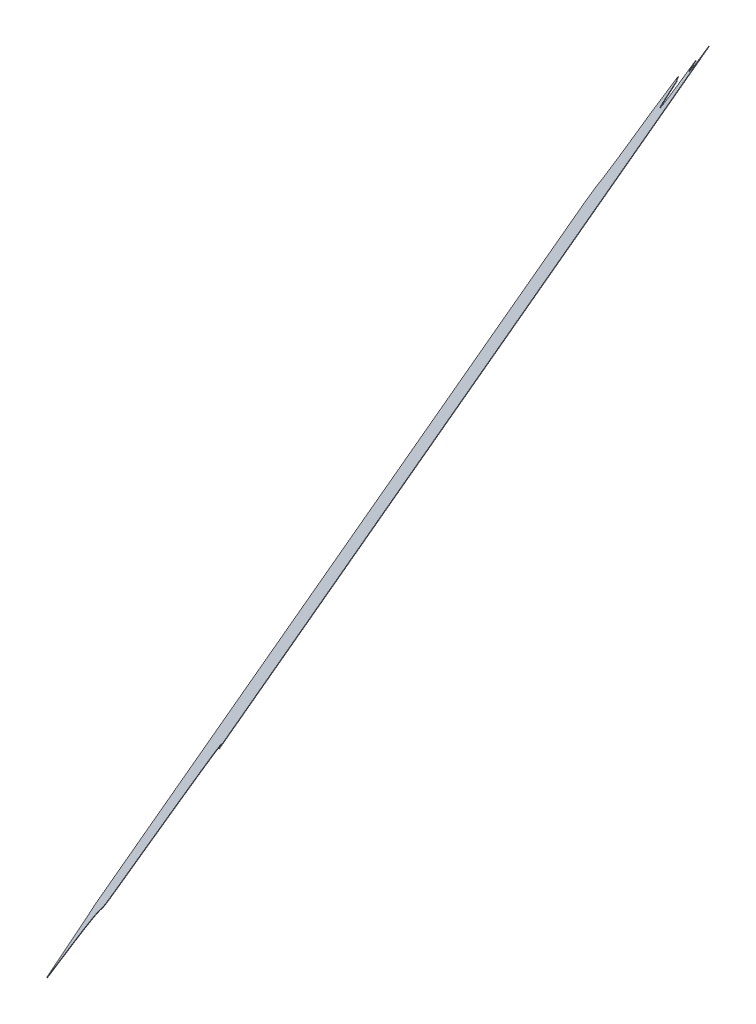
ISO-10303-21;
HEADER;
FILE_DESCRIPTION(('STEP AP214'),'2;1');
FILE_NAME('part.step','',(''),(''),'','','');
FILE_SCHEMA(('AUTOMOTIVE_DESIGN { 1 0 10303 214 1 1 1 1 }'));
ENDSEC;
DATA;
#1=APPLICATION_CONTEXT('core data for automotive mechanical design processes');
#2=APPLICATION_PROTOCOL_DEFINITION('international standard','automotive_design',2000,#1);
#3=PRODUCT_CONTEXT('',#1,'mechanical');
#4=PRODUCT('Part','Part','',(#3));
#5=PRODUCT_RELATED_PRODUCT_CATEGORY('part','',(#4));
#6=PRODUCT_DEFINITION_FORMATION('','',#4);
#7=PRODUCT_DEFINITION_CONTEXT('part definition',#1,'design');
#8=PRODUCT_DEFINITION('design','',#6,#7);
#9=PRODUCT_DEFINITION_SHAPE('','',#8);
#10=(LENGTH_UNIT() NAMED_UNIT(*) SI_UNIT(.MILLI.,.METRE.));
#11=(NAMED_UNIT(*) PLANE_ANGLE_UNIT() SI_UNIT($,.RADIAN.));
#12=(NAMED_UNIT(*) SI_UNIT($,.STERADIAN.) SOLID_ANGLE_UNIT());
#13=UNCERTAINTY_MEASURE_WITH_UNIT(LENGTH_MEASURE(1.E-05),#10,'distance_accuracy_value','');
#14=(GEOMETRIC_REPRESENTATION_CONTEXT(3) GLOBAL_UNCERTAINTY_ASSIGNED_CONTEXT((#13)) GLOBAL_UNIT_ASSIGNED_CONTEXT((#10,
#11,#12)) REPRESENTATION_CONTEXT('',''));
#15=CARTESIAN_POINT('',(0.,0.,0.));
#16=DIRECTION('',(0.,0.,1.));
#17=DIRECTION('',(1.,0.,0.));
#18=AXIS2_PLACEMENT_3D('',#15,#16,#17);
#19=CARTESIAN_POINT('',(2378.98586330096,525.802836481461,-13.0053149453881));
#20=CARTESIAN_POINT('',(2377.95048619296,525.234256569619,-14.5648775786979));
#21=CARTESIAN_POINT('',(2377.05251662314,524.480179693211,-15.5547361442591));
#22=CARTESIAN_POINT('',(2376.51053880873,524.025049640799,-16.152174409401));
#23=CARTESIAN_POINT('',(2375.47228998744,522.924832047889,-16.9792710675226));
#24=CARTESIAN_POINT('',(2374.4816957507,521.589286176894,-17.3711011531578));
#25=CARTESIAN_POINT('',(2373.61396610117,520.107998066241,-17.2814935268279));
#26=CARTESIAN_POINT('',(2373.23642727126,519.309794874412,-17.0288440016274));
#27=CARTESIAN_POINT('',(2372.61858630146,518.003538153108,-16.6153839405724));
#28=CARTESIAN_POINT('',(2372.08527277179,516.40840256996,-15.6085344689819));
#29=CARTESIAN_POINT('',(2371.661026262,515.128241786231,-14.7919652739403));
#30=CARTESIAN_POINT('',(2371.3044376191,513.709493935963,-13.6292015719265));
#31=CARTESIAN_POINT('',(2371.00750150893,512.528083713381,-12.6609527574912));
#32=CARTESIAN_POINT('',(2370.74303526046,511.201798996655,-11.4176326782293));
#33=CARTESIAN_POINT('',(2370.51752569134,510.070880035382,-10.3574574120617));
#34=CARTESIAN_POINT('',(2370.31041084756,508.808141508238,-9.07230240123195));
#35=CARTESIAN_POINT('',(2370.13244662952,507.723128621378,-7.96802806542277));
#36=CARTESIAN_POINT('',(2369.96126491284,506.498485847809,-6.65427268741517));
#37=CARTESIAN_POINT('',(2369.81716567713,505.467592531032,-5.54836517846949));
#38=CARTESIAN_POINT('',(2369.66409347263,504.23626044523,-4.18421013622098));
#39=CARTESIAN_POINT('',(2369.60083237433,503.727380205492,-3.6204373303769));
#40=CARTESIAN_POINT('',(2369.52728419044,503.114057526931,-2.93483572492473));
#41=CARTESIAN_POINT('',(2369.48391732098,502.752418623971,-2.5305783557931));
#42=CARTESIAN_POINT('',(2369.30517294324,501.242249762374,-0.837102069764316));
#43=CARTESIAN_POINT('',(2369.25999621537,500.868999121364,-0.420811889010696));
#44=CARTESIAN_POINT('',(2369.17968528452,500.205469294548,0.319229576941494));
#45=CARTESIAN_POINT('',(2369.11815396338,499.737635447647,0.829873246766278));
#46=CARTESIAN_POINT('',(2369.02996124873,499.067090167566,1.561777757037));
#47=CARTESIAN_POINT('',(2368.95241966779,498.584425716721,2.0566992121532));
#48=CARTESIAN_POINT('',(2368.90043391212,498.260835767778,2.38850655390385));
#49=CARTESIAN_POINT('',(2368.78329812853,497.651167907497,2.9701013029427));
#50=CARTESIAN_POINT('',(2368.71338142264,497.371508075547,3.20014901888518));
#51=CARTESIAN_POINT('',(2368.62103924177,497.002148586227,3.50398352485323));
#52=CARTESIAN_POINT('',(2368.4403612175,496.505163314007,3.78473218878658));
#53=CARTESIAN_POINT('',(2368.27210318452,496.134194848496,3.91850423969505));
#54=CARTESIAN_POINT('',(2368.06486322349,495.763891585507,3.9628780935986));
#55=CARTESIAN_POINT('',(2367.82826622419,495.406235693041,3.92304306599475));
#56=CARTESIAN_POINT('',(2367.47653222166,494.933689308545,3.78159193738589));
#57=CARTESIAN_POINT('',(2367.17782216072,494.581397741526,3.5933283446515));
#58=CARTESIAN_POINT('',(2366.95266722836,494.315855350052,3.45142325999345));
#59=CARTESIAN_POINT('',(2366.65698517721,493.987157878035,3.23723593780064));
#60=CARTESIAN_POINT('',(2366.43103591965,493.735979460286,3.07356192972205));
#61=CARTESIAN_POINT('',(2366.13842708481,493.419628304376,2.84918804507014));
#62=CARTESIAN_POINT('',(2365.91863901626,493.182006601746,2.68065347991716));
#63=CARTESIAN_POINT('',(2365.62021455958,492.863350642819,2.44628414182032));
#64=CARTESIAN_POINT('',(2365.44089594388,492.671875232015,2.30545525086442));
#65=CARTESIAN_POINT('',(2364.73623238226,491.922194165143,1.74821462176097));
#66=CARTESIAN_POINT('',(2364.57824600469,491.753788183044,1.62373465228368));
#67=CARTESIAN_POINT('',(2364.29361666252,491.450386809841,1.39947068490439));
#68=CARTESIAN_POINT('',(2363.49884187514,490.598243722331,0.780136825328038));
#69=CARTESIAN_POINT('',(2363.02307958304,490.077988249798,0.423506824970133));
#70=CARTESIAN_POINT('',(2362.47914520818,489.483185256952,0.0157752339520987));
#71=CARTESIAN_POINT('',(2361.44993518835,488.326183109015,-0.711875614328427));
#72=CARTESIAN_POINT('',(2359.87791061871,486.49948062064,-1.74060815894498));
#73=CARTESIAN_POINT('',(2357.85920881138,483.962327221928,-2.7955848828544));
#74=CARTESIAN_POINT('',(2355.89344980849,481.266584508941,-3.50996107345872));
#75=CARTESIAN_POINT('',(2354.00696709122,478.442349594944,-3.86580554331576));
#76=CARTESIAN_POINT('',(2353.07559507566,476.931591797833,-3.87967764642575));
#77=CARTESIAN_POINT('',(2352.21882138233,475.541838277286,-3.89243866223602));
#78=CARTESIAN_POINT('',(2351.30967701159,473.968106772552,-3.76832849173151));
#79=CARTESIAN_POINT('',(2350.89970110061,473.258437298644,-3.71236138479928));
#80=CARTESIAN_POINT('',(2350.45585450049,472.471351324407,-3.62565735238577));
#81=CARTESIAN_POINT('',(2350.07782001699,471.800971874255,-3.5518095092301));
#82=CARTESIAN_POINT('',(2349.4009610725,470.581329466304,-3.39269198174633));
#83=CARTESIAN_POINT('',(2348.99939992884,469.854466942097,-3.29372810723197));
#84=CARTESIAN_POINT('',(2348.54395941888,469.031235525686,-3.18309500624162));
#85=CARTESIAN_POINT('',(2348.3746889119,468.727411596368,-3.14495269199303));
#86=CARTESIAN_POINT('',(2348.13636975435,468.299652123265,-3.09125140426817));
#87=CARTESIAN_POINT('',(2347.9520060419,467.974611128578,-3.05787268566818));
#88=CARTESIAN_POINT('',(2347.71106140159,467.549815573576,-3.01425009182702));
#89=CARTESIAN_POINT('',(2347.51913558315,467.224293350162,-2.99736544794841));
#90=CARTESIAN_POINT('',(2347.26906299397,466.800149345422,-2.97536535100155));
#91=CARTESIAN_POINT('',(2346.94318604778,466.292012590469,-3.00866008972426));
#92=CARTESIAN_POINT('',(2346.69861049942,465.938931261904,-3.07296197380761));
#93=CARTESIAN_POINT('',(2346.44468266598,465.613922432459,-3.19751100219615));
#94=CARTESIAN_POINT('',(2346.18731122299,465.338061733721,-3.39819223411367));
#95=CARTESIAN_POINT('',(2345.93556789435,465.125120769091,-3.67355916146509));
#96=CARTESIAN_POINT('',(2345.69673124601,464.9704018501,-4.00056246771255));
#97=CARTESIAN_POINT('',(2345.38266277725,464.815111959173,-4.49751858771422));
#98=CARTESIAN_POINT('',(2345.1507798393,464.744816648923,-4.92608968978328));
#99=CARTESIAN_POINT('',(2344.97047867158,464.690158351786,-5.25932623939021));
#100=CARTESIAN_POINT('',(2344.57972573189,464.611684642948,-6.03710131488203));
#101=CARTESIAN_POINT('',(2344.37275105138,464.582031062254,-6.46563308410012));
#102=CARTESIAN_POINT('',(2344.06329743944,464.537695167498,-7.10634287277104));
#103=CARTESIAN_POINT('',(2343.63422519704,464.499504746074,-8.02708192625748));
#104=CARTESIAN_POINT('',(2343.34296271572,464.47358035431,-8.65209728468256));
#105=CARTESIAN_POINT('',(2342.9090759015,464.443031381775,-9.5943852298738));
#106=CARTESIAN_POINT('',(2342.84264443254,464.438354094856,-9.73865689319201));
#107=CARTESIAN_POINT('',(2342.18748677087,464.39378992435,-11.1636608166376));
#108=CARTESIAN_POINT('',(2341.76056044255,464.364750169797,-12.0922490458017));
#109=CARTESIAN_POINT('',(2341.46440303118,464.342510725014,-12.733496085689));
#110=CARTESIAN_POINT('',(2340.6523287176,464.281529364554,-14.4918186187658));
#111=CARTESIAN_POINT('',(2340.00372490056,464.211095600756,-15.8659888198961));
#112=CARTESIAN_POINT('',(2339.21161799369,464.125078421523,-17.54419310875));
#113=CARTESIAN_POINT('',(2338.51394927523,464.01038792688,-18.9682037677329));
#114=CARTESIAN_POINT('',(2337.70142221644,463.876815748828,-20.6266516267239));
#115=CARTESIAN_POINT('',(2336.97040492629,463.697109791135,-22.035977971112));
#116=CARTESIAN_POINT('',(2336.11160445534,463.485990898081,-23.691657179516));
#117=CARTESIAN_POINT('',(2335.33830230719,463.204726017414,-25.0557851365371));
#118=CARTESIAN_POINT('',(2334.411475482,462.867621255701,-26.690735183658));
#119=CARTESIAN_POINT('',(2333.58584523021,462.421932257931,-27.9450754707062));
#120=B_SPLINE_CURVE_WITH_KNOTS('',2,(#19,#20,#21,#22,#23,#24,#25,#26,#27,#28,#29,#30,#31,#32,
#33,#34,#35,#36,#37,#38,#39,#40,#41,#42,#43,#44,#45,#46,#47,#48,#49,#50,#51,#52,#53,#54,#55,#56,
#57,#58,#59,#60,#61,#62,#63,#64,#65,#66,#67,#68,#69,#70,#71,#72,#73,#74,#75,#76,#77,#78,#79,#80,
#81,#82,#83,#84,#85,#86,#87,#88,#89,#90,#91,#92,#93,#94,#95,#96,#97,#98,#99,#100,#101,#102,#103,
#104,#105,#106,#107,#108,#109,#110,#111,#112,#113,#114,#115,#116,#117,#118,#119),.UNSPECIFIED.,
.F.,.F.,(3,2,1,1,1,2,1,1,2,2,2,2,2,2,1,2,2,2,1,2,1,1,1,1,1,2,2,2,2,1,2,1,2,1,1,1,1,1,2,2,2,1,1,
1,2,2,2,1,1,1,1,1,1,1,2,1,2,2,2,2,2,2,2,2,2,3),(0.,0.03125,0.046875,0.0625,0.078125,0.09375,
0.124108791351318,0.125,0.15625,0.1875,0.21875,0.25,0.28125,0.296875,0.3125,0.328125,0.34375,
0.359375,0.3671875,0.375,0.3828125,0.38671875,0.390625,0.39453125,0.3984375,0.40625,0.4140625,
0.421875,0.4296875,0.4375,0.4453125,0.453125,0.46875,0.484375,0.5,0.53125,0.5625,0.59375,0.625,
0.65625,0.671875,0.6875,0.6953125,0.703125,0.7109375,0.71875,0.7265625,0.734375,0.73828125,
0.7421875,0.74609375,0.75,0.75390625,0.7578125,0.765625,0.7734375,0.78125,0.796875,0.8125,
0.828125,0.84375,0.875,0.90625,0.9375,0.96875,1.),.UNSPECIFIED.);
#121=DIRECTION('',(-0.798283907615501,0.488907013026806,0.35172821248136));
#122=VECTOR('',#121,1.);
#123=SURFACE_OF_LINEAR_EXTRUSION('',#120,#122);
#124=CARTESIAN_POINT('',(2378.9060349102,525.851727182764,-12.9701421241399));
#125=CARTESIAN_POINT('',(2377.8706578022,525.283147270922,-14.5297047574497));
#126=CARTESIAN_POINT('',(2376.97268823238,524.529070394514,-15.519563323011));
#127=CARTESIAN_POINT('',(2376.43071041797,524.073940342102,-16.1170015881529));
#128=CARTESIAN_POINT('',(2375.39246159668,522.973722749192,-16.9440982462745));
#129=CARTESIAN_POINT('',(2374.40186735994,521.638176878197,-17.3359283319097));
#130=CARTESIAN_POINT('',(2373.53413771041,520.156888767543,-17.2463207055797));
#131=CARTESIAN_POINT('',(2373.15659888049,519.358685575715,-16.9936711803793));
#132=CARTESIAN_POINT('',(2372.5387579107,518.052428854411,-16.5802111193243));
#133=CARTESIAN_POINT('',(2372.00544438103,516.457293271263,-15.5733616477338));
#134=CARTESIAN_POINT('',(2371.58119787124,515.177132487533,-14.7567924526921));
#135=CARTESIAN_POINT('',(2371.22460922834,513.758384637265,-13.5940287506784));
#136=CARTESIAN_POINT('',(2370.92767311816,512.576974414684,-12.625779936243));
#137=CARTESIAN_POINT('',(2370.6632068697,511.250689697958,-11.3824598569812));
#138=CARTESIAN_POINT('',(2370.43769730058,510.119770736685,-10.3222845908135));
#139=CARTESIAN_POINT('',(2370.23058245679,508.857032209541,-9.03712957998382));
#140=CARTESIAN_POINT('',(2370.05261823876,507.772019322681,-7.93285524417464));
#141=CARTESIAN_POINT('',(2369.88143652208,506.547376549112,-6.61909986616704));
#142=CARTESIAN_POINT('',(2369.73733728637,505.516483232335,-5.51319235722136));
#143=CARTESIAN_POINT('',(2369.58426508187,504.285151146533,-4.14903731497285));
#144=CARTESIAN_POINT('',(2369.52100398357,503.776270906795,-3.58526450912877));
#145=CARTESIAN_POINT('',(2369.44745579967,503.162948228234,-2.8996629036766));
#146=CARTESIAN_POINT('',(2369.40408893021,502.801309325273,-2.49540553454497));
#147=CARTESIAN_POINT('',(2369.22534455248,501.291140463677,-0.801929248516187));
#148=CARTESIAN_POINT('',(2369.18016782461,500.917889822666,-0.385639067762567));
#149=CARTESIAN_POINT('',(2369.09985689376,500.254359995851,0.354402398189624));
#150=CARTESIAN_POINT('',(2369.03832557262,499.786526148949,0.865046068014408));
#151=CARTESIAN_POINT('',(2368.95013285797,499.115980868869,1.59695057828513));
#152=CARTESIAN_POINT('',(2368.87259127703,498.633316418024,2.09187203340133));
#153=CARTESIAN_POINT('',(2368.82060552136,498.30972646908,2.42367937515198));
#154=CARTESIAN_POINT('',(2368.70346973777,497.700058608799,3.00527412419083));
#155=CARTESIAN_POINT('',(2368.63355303188,497.420398776849,3.23532184013331));
#156=CARTESIAN_POINT('',(2368.54121085101,497.05103928753,3.53915634610136));
#157=CARTESIAN_POINT('',(2368.36053282674,496.55405401531,3.81990501003471));
#158=CARTESIAN_POINT('',(2368.19227479376,496.183085549799,3.95367706094318));
#159=CARTESIAN_POINT('',(2367.98503483272,495.81278228681,3.99805091484673));
#160=CARTESIAN_POINT('',(2367.74843783343,495.455126394344,3.95821588724288));
#161=CARTESIAN_POINT('',(2367.3967038309,494.982580009848,3.81676475863402));
#162=CARTESIAN_POINT('',(2367.09799376995,494.630288442828,3.62850116589963));
#163=CARTESIAN_POINT('',(2366.8728388376,494.364746051354,3.48659608124158));
#164=CARTESIAN_POINT('',(2366.57715678645,494.036048579337,3.27240875904877));
#165=CARTESIAN_POINT('',(2366.35120752889,493.784870161589,3.10873475097018));
#166=CARTESIAN_POINT('',(2366.05859869405,493.468519005679,2.88436086631827));
#167=CARTESIAN_POINT('',(2365.8388106255,493.230897303049,2.71582630116529));
#168=CARTESIAN_POINT('',(2365.54038616882,492.912241344122,2.48145696306845));
#169=CARTESIAN_POINT('',(2365.36106755312,492.720765933317,2.34062807211255));
#170=CARTESIAN_POINT('',(2364.6564039915,491.971084866445,1.7833874430091));
#171=CARTESIAN_POINT('',(2364.49841761393,491.802678884347,1.65890747353181));
#172=CARTESIAN_POINT('',(2364.21378827176,491.499277511144,1.43464350615252));
#173=CARTESIAN_POINT('',(2363.41901348438,490.647134423633,0.815309646576168));
#174=CARTESIAN_POINT('',(2362.94325119228,490.126878951101,0.458679646218263));
#175=CARTESIAN_POINT('',(2362.39931681742,489.532075958255,0.0509480552002284));
#176=CARTESIAN_POINT('',(2361.37010679759,488.375073810318,-0.676702793080297));
#177=CARTESIAN_POINT('',(2359.79808222795,486.548371321942,-1.70543533769685));
#178=CARTESIAN_POINT('',(2357.77938042062,484.01121792323,-2.76041206160627));
#179=CARTESIAN_POINT('',(2355.81362141773,481.315475210243,-3.47478825221059));
#180=CARTESIAN_POINT('',(2353.92713870046,478.491240296247,-3.83063272206763));
#181=CARTESIAN_POINT('',(2352.9957666849,476.980482499135,-3.84450482517762));
#182=CARTESIAN_POINT('',(2352.13899299157,475.590728978589,-3.85726584098789));
#183=CARTESIAN_POINT('',(2351.22984862082,474.016997473854,-3.73315567048338));
#184=CARTESIAN_POINT('',(2350.81987270984,473.307327999947,-3.67718856355115));
#185=CARTESIAN_POINT('',(2350.37602610973,472.52024202571,-3.59048453113764));
#186=CARTESIAN_POINT('',(2349.99799162623,471.849862575558,-3.51663668798197));
#187=CARTESIAN_POINT('',(2349.32113268173,470.630220167607,-3.3575191604982));
#188=CARTESIAN_POINT('',(2348.91957153807,469.903357643399,-3.25855528598384));
#189=CARTESIAN_POINT('',(2348.46413102812,469.080126226988,-3.14792218499349));
#190=CARTESIAN_POINT('',(2348.29486052113,468.776302297671,-3.1097798707449));
#191=CARTESIAN_POINT('',(2348.05654136358,468.348542824568,-3.05607858302004));
#192=CARTESIAN_POINT('',(2347.87217765114,468.023501829881,-3.02269986442005));
#193=CARTESIAN_POINT('',(2347.63123301082,467.598706274879,-2.97907727057889));
#194=CARTESIAN_POINT('',(2347.43930719239,467.273184051464,-2.96219262670028));
#195=CARTESIAN_POINT('',(2347.18923460321,466.849040046725,-2.94019252975342));
#196=CARTESIAN_POINT('',(2346.86335765702,466.340903291771,-2.97348726847613));
#197=CARTESIAN_POINT('',(2346.61878210866,465.987821963206,-3.03778915255948));
#198=CARTESIAN_POINT('',(2346.36485427521,465.662813133762,-3.16233818094802));
#199=CARTESIAN_POINT('',(2346.10748283223,465.386952435023,-3.36301941286554));
#200=CARTESIAN_POINT('',(2345.85573950359,465.174011470394,-3.63838634021696));
#201=CARTESIAN_POINT('',(2345.61690285524,465.019292551403,-3.96538964646442));
#202=CARTESIAN_POINT('',(2345.30283438649,464.864002660475,-4.46234576646609));
#203=CARTESIAN_POINT('',(2345.07095144854,464.793707350226,-4.89091686853516));
#204=CARTESIAN_POINT('',(2344.89065028082,464.739049053089,-5.22415341814209));
#205=CARTESIAN_POINT('',(2344.49989734113,464.660575344251,-6.0019284936339));
#206=CARTESIAN_POINT('',(2344.29292266061,464.630921763557,-6.43046026285199));
#207=CARTESIAN_POINT('',(2343.98346904868,464.586585868801,-7.07117005152291));
#208=CARTESIAN_POINT('',(2343.55439680628,464.548395447376,-7.99190910500935));
#209=CARTESIAN_POINT('',(2343.26313432495,464.522471055612,-8.61692446343443));
#210=CARTESIAN_POINT('',(2342.82924751074,464.491922083078,-9.55921240862567));
#211=CARTESIAN_POINT('',(2342.76281604178,464.487244796159,-9.70348407194388));
#212=CARTESIAN_POINT('',(2342.10765838011,464.442680625652,-11.1284879953895));
#213=CARTESIAN_POINT('',(2341.68073205179,464.413640871099,-12.0570762245535));
#214=CARTESIAN_POINT('',(2341.38457464042,464.391401426317,-12.6983232644409));
#215=CARTESIAN_POINT('',(2340.57250032684,464.330420065857,-14.4566457975177));
#216=CARTESIAN_POINT('',(2339.9238965098,464.259986302058,-15.830815998648));
#217=CARTESIAN_POINT('',(2339.13178960293,464.173969122826,-17.5090202875019));
#218=CARTESIAN_POINT('',(2338.43412088446,464.059278628183,-18.9330309464848));
#219=CARTESIAN_POINT('',(2337.62159382568,463.925706450131,-20.5914788054757));
#220=CARTESIAN_POINT('',(2336.89057653553,463.746000492438,-22.0008051498639));
#221=CARTESIAN_POINT('',(2336.03177606458,463.534881599383,-23.6564843582678));
#222=CARTESIAN_POINT('',(2335.25847391643,463.253616718717,-25.020612315289));
#223=CARTESIAN_POINT('',(2334.33164709124,462.916511957004,-26.6555623624098));
#224=CARTESIAN_POINT('',(2333.50601683945,462.470822959233,-27.909902649458));
#225=B_SPLINE_CURVE_WITH_KNOTS('',2,(#124,#125,#126,#127,#128,#129,#130,#131,#132,#133,#134,
#135,#136,#137,#138,#139,#140,#141,#142,#143,#144,#145,#146,#147,#148,#149,#150,#151,#152,#153,
#154,#155,#156,#157,#158,#159,#160,#161,#162,#163,#164,#165,#166,#167,#168,#169,#170,#171,#172,
#173,#174,#175,#176,#177,#178,#179,#180,#181,#182,#183,#184,#185,#186,#187,#188,#189,#190,#191,
#192,#193,#194,#195,#196,#197,#198,#199,#200,#201,#202,#203,#204,#205,#206,#207,#208,#209,#210,
#211,#212,#213,#214,#215,#216,#217,#218,#219,#220,#221,#222,#223,#224),.UNSPECIFIED.,.F.,.F.,(3,
2,1,1,1,2,1,1,2,2,2,2,2,2,1,2,2,2,1,2,1,1,1,1,1,2,2,2,2,1,2,1,2,1,1,1,1,1,2,2,2,1,1,1,2,2,2,1,1,
1,1,1,1,1,2,1,2,2,2,2,2,2,2,2,2,3),(0.,0.03125,0.046875,0.0625,0.078125,0.09375,
0.124108791351318,0.125,0.15625,0.1875,0.21875,0.25,0.28125,0.296875,0.3125,0.328125,0.34375,
0.359375,0.3671875,0.375,0.3828125,0.38671875,0.390625,0.39453125,0.3984375,0.40625,0.4140625,
0.421875,0.4296875,0.4375,0.4453125,0.453125,0.46875,0.484375,0.5,0.53125,0.5625,0.59375,0.625,
0.65625,0.671875,0.6875,0.6953125,0.703125,0.7109375,0.71875,0.7265625,0.734375,0.73828125,
0.7421875,0.74609375,0.75,0.75390625,0.7578125,0.765625,0.7734375,0.78125,0.796875,0.8125,
0.828125,0.84375,0.875,0.90625,0.9375,0.96875,1.),.UNSPECIFIED.);
#226=CARTESIAN_POINT('',(2378.9060349102,525.851727182764,-12.9701421241396));
#227=VERTEX_POINT('',#226);
#228=CARTESIAN_POINT('',(2333.50601683945,462.470822959233,-27.909902649458));
#229=VERTEX_POINT('',#228);
#230=EDGE_CURVE('E226',#227,#229,#225,.T.);
#231=ORIENTED_EDGE('',*,*,#230,.T.);
#232=DIRECTION('',(-0.798283907615501,0.488907013026806,0.35172821248136));
#233=VECTOR('',#232,1.);
#234=CARTESIAN_POINT('',(2333.58584523021,462.421932257931,-27.9450754707062));
#235=LINE('',#234,#233);
#236=CARTESIAN_POINT('',(2333.58584523021,462.421932257931,-27.9450754707062));
#237=VERTEX_POINT('',#236);
#238=EDGE_CURVE('E13',#237,#229,#235,.T.);
#239=ORIENTED_EDGE('',*,*,#238,.F.);
#240=CARTESIAN_POINT('',(2378.98586330096,525.802836481461,-13.0053149453877));
#241=VERTEX_POINT('',#240);
#242=EDGE_CURVE('E278',#241,#237,#120,.T.);
#243=ORIENTED_EDGE('',*,*,#242,.F.);
#244=DIRECTION('',(-0.798283907615501,0.488907013026806,0.35172821248136));
#245=VECTOR('',#244,1.);
#246=CARTESIAN_POINT('',(2378.98586330096,525.802836481461,-13.0053149453877));
#247=LINE('',#246,#245);
#248=EDGE_CURVE('E68',#241,#227,#247,.T.);
#249=ORIENTED_EDGE('',*,*,#248,.T.);
#250=EDGE_LOOP('',(#231,#239,#243,#249));
#251=FACE_BOUND('',#250,.T.);
#252=ADVANCED_FACE('F51',(#251),#123,.F.);
#253=CARTESIAN_POINT('',(2333.58584523021,462.421932257931,-27.9450754707056));
#254=DIRECTION('',(0.572173363057329,0.797953482989953,0.18944097125983));
#255=DIRECTION('',(-0.812669206458009,0.58272528765698,0.));
#256=AXIS2_PLACEMENT_3D('',#253,#254,#255);
#257=PLANE('',#256);
#258=DIRECTION('',(-0.188043732811793,0.352477193017377,-0.916732994362479));
#259=VECTOR('',#258,1.);
#260=CARTESIAN_POINT('',(2333.50601683944,462.470822959233,-27.9099026494575));
#261=LINE('',#260,#259);
#262=CARTESIAN_POINT('',(2302.34431198831,520.881651607037,-179.826494446805));
#263=VERTEX_POINT('',#262);
#264=EDGE_CURVE('E220',#229,#263,#261,.T.);
#265=ORIENTED_EDGE('',*,*,#264,.T.);
#266=DIRECTION('',(-0.798283907615501,0.488907013026806,0.35172821248136));
#267=VECTOR('',#266,1.);
#268=CARTESIAN_POINT('',(2302.42414037908,520.832760905735,-179.861667268053));
#269=LINE('',#268,#267);
#270=CARTESIAN_POINT('',(2302.42414037908,520.832760905735,-179.861667268053));
#271=VERTEX_POINT('',#270);
#272=EDGE_CURVE('E60',#271,#263,#269,.T.);
#273=ORIENTED_EDGE('',*,*,#272,.F.);
#274=DIRECTION('',(-0.188043732811793,0.352477193017377,-0.916732994362479));
#275=VECTOR('',#274,1.);
#276=CARTESIAN_POINT('',(2333.58584523021,462.421932257931,-27.9450754707056));
#277=LINE('',#276,#275);
#278=EDGE_CURVE('E109',#237,#271,#277,.T.);
#279=ORIENTED_EDGE('',*,*,#278,.F.);
#280=ORIENTED_EDGE('',*,*,#238,.T.);
#281=EDGE_LOOP('',(#265,#273,#279,#280));
#282=FACE_BOUND('',#281,.T.);
#283=ADVANCED_FACE('F213',(#282),#257,.F.);
#284=CARTESIAN_POINT('',(2303.50879295341,523.948753446937,-181.731207120574));
#285=CARTESIAN_POINT('',(2302.99030970947,522.276751641642,-180.583853669601));
#286=CARTESIAN_POINT('',(2302.42414037908,520.832760905735,-179.861667268053));
#287=B_SPLINE_CURVE_WITH_KNOTS('',2,(#284,#285,#286),.UNSPECIFIED.,.F.,.F.,(3,3),(0.,1.),.UNSPECIFIED.);
#288=DIRECTION('',(-0.798283907615501,0.488907013026806,0.35172821248136));
#289=VECTOR('',#288,1.);
#290=SURFACE_OF_LINEAR_EXTRUSION('',#287,#289);
#291=CARTESIAN_POINT('',(2303.42896456265,523.99764414824,-181.696034299325));
#292=CARTESIAN_POINT('',(2302.9104813187,522.325642342945,-180.548680848353));
#293=CARTESIAN_POINT('',(2302.34431198831,520.881651607037,-179.826494446805));
#294=B_SPLINE_CURVE_WITH_KNOTS('',2,(#291,#292,#293),.UNSPECIFIED.,.F.,.F.,(3,3),(0.,1.),.UNSPECIFIED.);
#295=CARTESIAN_POINT('',(2303.42896442417,523.997643701694,-181.696033992899));
#296=VERTEX_POINT('',#295);
#297=EDGE_CURVE('E225',#296,#263,#294,.T.);
#298=ORIENTED_EDGE('',*,*,#297,.F.);
#299=DIRECTION('',(-0.798283907615501,0.488907013026806,0.35172821248136));
#300=VECTOR('',#299,1.);
#301=CARTESIAN_POINT('',(2303.50879281494,523.948753000392,-181.731206814147));
#302=LINE('',#301,#300);
#303=CARTESIAN_POINT('',(2303.50879281494,523.948753000392,-181.731206814147));
#304=VERTEX_POINT('',#303);
#305=EDGE_CURVE('E286',#304,#296,#302,.T.);
#306=ORIENTED_EDGE('',*,*,#305,.F.);
#307=EDGE_CURVE('E199',#304,#271,#287,.T.);
#308=ORIENTED_EDGE('',*,*,#307,.T.);
#309=ORIENTED_EDGE('',*,*,#272,.T.);
#310=EDGE_LOOP('',(#298,#306,#308,#309));
#311=FACE_BOUND('',#310,.T.);
#312=ADVANCED_FACE('F210',(#311),#290,.T.);
#313=CARTESIAN_POINT('',(2303.50879295341,523.948753446937,-181.731207120574));
#314=CARTESIAN_POINT('',(2304.33330332581,524.867557181696,-181.137044454584));
#315=CARTESIAN_POINT('',(2305.84256699189,526.946062117429,-180.600763170926));
#316=CARTESIAN_POINT('',(2307.15133478719,529.16274548303,-180.711598105177));
#317=CARTESIAN_POINT('',(2307.75764387258,530.386973051902,-181.037209341328));
#318=CARTESIAN_POINT('',(2307.81450617571,530.50287064941,-181.069253647915));
#319=CARTESIAN_POINT('',(2308.32222922314,531.546059927007,-181.366970497817));
#320=CARTESIAN_POINT('',(2308.80619467513,532.69095622215,-181.859981833182));
#321=CARTESIAN_POINT('',(2308.85269137228,532.80174979005,-181.908457294187));
#322=CARTESIAN_POINT('',(2309.27804256405,533.822082583935,-182.361354848107));
#323=CARTESIAN_POINT('',(2309.69223195347,534.938122432219,-182.972619389129));
#324=CARTESIAN_POINT('',(2309.73191028898,535.045669671053,-183.032057392216));
#325=CARTESIAN_POINT('',(2310.09383430695,536.031979447142,-183.581617081662));
#326=CARTESIAN_POINT('',(2310.45595207155,537.114625480042,-184.264645753922));
#327=CARTESIAN_POINT('',(2310.4906077976,537.218718844187,-184.330682160744));
#328=CARTESIAN_POINT('',(2310.80667029022,538.172084828542,-184.938537051219));
#329=CARTESIAN_POINT('',(2311.13712294057,539.241171956086,-185.674585943513));
#330=CARTESIAN_POINT('',(2311.16795544306,539.341259838337,-185.743731880985));
#331=CARTESIAN_POINT('',(2311.4563482005,540.280257465007,-186.394413911686));
#332=CARTESIAN_POINT('',(2311.78440626646,541.39882177648,-187.204671523865));
#333=B_SPLINE_CURVE_WITH_KNOTS('',2,(#313,#314,#315,#316,#317,#318,#319,#320,#321,#322,#323,
#324,#325,#326,#327,#328,#329,#330,#331,#332),.UNSPECIFIED.,.F.,.F.,(3,1,1,1,1,1,1,1,1,1,1,1,1,
1,1,1,1,1,3),(0.,0.125,0.25,0.36875,0.375,0.38125,0.4940625,0.5,0.50625,0.6190625,0.625,0.63125,
0.7440625,0.75,0.75625,0.8690625,0.875,0.88125,1.),.UNSPECIFIED.);
#334=DIRECTION('',(-0.798283907615501,0.488907013026806,0.35172821248136));
#335=VECTOR('',#334,1.);
#336=SURFACE_OF_LINEAR_EXTRUSION('',#333,#335);
#337=CARTESIAN_POINT('',(2303.42896456265,523.99764414824,-181.696034299326));
#338=CARTESIAN_POINT('',(2304.25347493505,524.916447882999,-181.101871633336));
#339=CARTESIAN_POINT('',(2305.76273860113,526.994952818731,-180.565590349678));
#340=CARTESIAN_POINT('',(2307.07150639643,529.211636184332,-180.676425283929));
#341=CARTESIAN_POINT('',(2307.67781548182,530.435863753204,-181.00203652008));
#342=CARTESIAN_POINT('',(2307.73467778495,530.551761350712,-181.034080826667));
#343=CARTESIAN_POINT('',(2308.24240083238,531.594950628309,-181.331797676568));
#344=CARTESIAN_POINT('',(2308.72636628437,532.739846923452,-181.824809011934));
#345=CARTESIAN_POINT('',(2308.77286298152,532.850640491353,-181.873284472939));
#346=CARTESIAN_POINT('',(2309.19821417329,533.870973285237,-182.326182026858));
#347=CARTESIAN_POINT('',(2309.61240356271,534.987013133522,-182.937446567881));
#348=CARTESIAN_POINT('',(2309.65208189822,535.094560372355,-182.996884570968));
#349=CARTESIAN_POINT('',(2310.01400591619,536.080870148444,-183.546444260413));
#350=CARTESIAN_POINT('',(2310.37612368079,537.163516181345,-184.229472932674));
#351=CARTESIAN_POINT('',(2310.41077940684,537.26760954549,-184.295509339496));
#352=CARTESIAN_POINT('',(2310.72684189946,538.220975529845,-184.903364229971));
#353=CARTESIAN_POINT('',(2311.05729454981,539.290062657389,-185.639413122265));
#354=CARTESIAN_POINT('',(2311.08812705229,539.39015053964,-185.708559059737));
#355=CARTESIAN_POINT('',(2311.37651980974,540.329148166309,-186.359241090438));
#356=CARTESIAN_POINT('',(2311.7045778757,541.447712477782,-187.169498702617));
#357=B_SPLINE_CURVE_WITH_KNOTS('',2,(#337,#338,#339,#340,#341,#342,#343,#344,#345,#346,#347,
#348,#349,#350,#351,#352,#353,#354,#355,#356),.UNSPECIFIED.,.F.,.F.,(3,1,1,1,1,1,1,1,1,1,1,1,1,
1,1,1,1,1,3),(0.,0.125,0.25,0.36875,0.375,0.38125,0.4940625,0.5,0.50625,0.6190625,0.625,0.63125,
0.7440625,0.75,0.75625,0.8690625,0.875,0.88125,1.),.UNSPECIFIED.);
#358=CARTESIAN_POINT('',(2311.704577657,541.447711732072,-187.169498162445));
#359=VERTEX_POINT('',#358);
#360=EDGE_CURVE('E233',#296,#359,#357,.T.);
#361=ORIENTED_EDGE('',*,*,#360,.T.);
#362=DIRECTION('',(-0.798283907615501,0.488907013026806,0.35172821248136));
#363=VECTOR('',#362,1.);
#364=CARTESIAN_POINT('',(2311.78440604776,541.39882103077,-187.204670983693));
#365=LINE('',#364,#363);
#366=CARTESIAN_POINT('',(2311.78440604776,541.39882103077,-187.204670983693));
#367=VERTEX_POINT('',#366);
#368=EDGE_CURVE('E284',#367,#359,#365,.T.);
#369=ORIENTED_EDGE('',*,*,#368,.F.);
#370=EDGE_CURVE('E191',#304,#367,#333,.T.);
#371=ORIENTED_EDGE('',*,*,#370,.F.);
#372=ORIENTED_EDGE('',*,*,#305,.T.);
#373=EDGE_LOOP('',(#361,#369,#371,#372));
#374=FACE_BOUND('',#373,.T.);
#375=ADVANCED_FACE('F207',(#374),#336,.F.);
#376=CARTESIAN_POINT('',(2315.96859575956,549.557319390791,-189.04863950149));
#377=CARTESIAN_POINT('',(2315.87009412015,549.355544125355,-188.99172888699));
#378=CARTESIAN_POINT('',(2315.59474823759,548.789862497148,-188.830349941325));
#379=CARTESIAN_POINT('',(2315.20754588214,547.994222229829,-188.603195296459));
#380=CARTESIAN_POINT('',(2314.98164089777,547.533396718973,-188.475356502831));
#381=CARTESIAN_POINT('',(2314.94292886584,547.454464031886,-188.453499990118));
#382=CARTESIAN_POINT('',(2314.42287250527,546.395498309856,-188.161845409321));
#383=CARTESIAN_POINT('',(2313.98150812613,545.522431633536,-187.949993368506));
#384=CARTESIAN_POINT('',(2313.93225627187,545.42518489033,-187.926601295361));
#385=CARTESIAN_POINT('',(2313.41214923084,544.400545492332,-187.682775797811));
#386=CARTESIAN_POINT('',(2312.92253079853,543.47752212692,-187.511000890336));
#387=CARTESIAN_POINT('',(2312.86996130541,543.378668243655,-187.492904598437));
#388=CARTESIAN_POINT('',(2312.30730147158,542.323692896848,-187.303489725097));
#389=CARTESIAN_POINT('',(2311.78440626646,541.39882177648,-187.204671523865));
#390=B_SPLINE_CURVE_WITH_KNOTS('',2,(#376,#377,#378,#379,#380,#381,#382,#383,#384,#385,#386,
#387,#388,#389),.UNSPECIFIED.,.F.,.F.,(3,1,1,1,1,1,1,1,1,1,1,1,3),(0.,0.0625,0.125,0.24375,0.25,
0.2625,0.488125,0.5,0.5125,0.738125,0.75,0.7625,1.),.UNSPECIFIED.);
#391=DIRECTION('',(-0.798283907615501,0.488907013026806,0.35172821248136));
#392=VECTOR('',#391,1.);
#393=SURFACE_OF_LINEAR_EXTRUSION('',#390,#392);
#394=CARTESIAN_POINT('',(2315.8887673688,549.606210092094,-189.013466680241));
#395=CARTESIAN_POINT('',(2315.79026572939,549.404434826658,-188.956556065742));
#396=CARTESIAN_POINT('',(2315.51491984682,548.838753198451,-188.795177120077));
#397=CARTESIAN_POINT('',(2315.12771749138,548.043112931132,-188.568022475211));
#398=CARTESIAN_POINT('',(2314.90181250701,547.582287420276,-188.440183681583));
#399=CARTESIAN_POINT('',(2314.86310047507,547.503354733189,-188.418327168869));
#400=CARTESIAN_POINT('',(2314.34304411451,546.444389011159,-188.126672588073));
#401=CARTESIAN_POINT('',(2313.90167973537,545.571322334839,-187.914820547258));
#402=CARTESIAN_POINT('',(2313.85242788111,545.474075591633,-187.891428474113));
#403=CARTESIAN_POINT('',(2313.33232084008,544.449436193635,-187.647602976563));
#404=CARTESIAN_POINT('',(2312.84270240777,543.526412828223,-187.475828069088));
#405=CARTESIAN_POINT('',(2312.79013291465,543.427558944958,-187.457731777189));
#406=CARTESIAN_POINT('',(2312.22747308082,542.372583598151,-187.268316903849));
#407=CARTESIAN_POINT('',(2311.7045778757,541.447712477782,-187.169498702617));
#408=B_SPLINE_CURVE_WITH_KNOTS('',2,(#394,#395,#396,#397,#398,#399,#400,#401,#402,#403,#404,
#405,#406,#407),.UNSPECIFIED.,.F.,.F.,(3,1,1,1,1,1,1,1,1,1,1,1,3),(0.,0.0625,0.125,0.24375,0.25,
0.2625,0.488125,0.5,0.5125,0.738125,0.75,0.7625,1.),.UNSPECIFIED.);
#409=CARTESIAN_POINT('',(2315.8887671216,549.606209585718,-189.013466537419));
#410=VERTEX_POINT('',#409);
#411=EDGE_CURVE('E235',#410,#359,#408,.T.);
#412=ORIENTED_EDGE('',*,*,#411,.F.);
#413=DIRECTION('',(-0.798283907615501,0.488907013026806,0.35172821248136));
#414=VECTOR('',#413,1.);
#415=CARTESIAN_POINT('',(2315.96859551236,549.557318884416,-189.048639358667));
#416=LINE('',#415,#414);
#417=CARTESIAN_POINT('',(2315.96859551236,549.557318884416,-189.048639358667));
#418=VERTEX_POINT('',#417);
#419=EDGE_CURVE('E282',#418,#410,#416,.T.);
#420=ORIENTED_EDGE('',*,*,#419,.F.);
#421=EDGE_CURVE('E182',#418,#367,#390,.T.);
#422=ORIENTED_EDGE('',*,*,#421,.T.);
#423=ORIENTED_EDGE('',*,*,#368,.T.);
#424=EDGE_LOOP('',(#412,#420,#422,#423));
#425=FACE_BOUND('',#424,.T.);
#426=ADVANCED_FACE('F175',(#425),#393,.T.);
#427=CARTESIAN_POINT('',(2315.96859575956,549.557319390791,-189.04863950149));
#428=CARTESIAN_POINT('',(2316.08893578526,549.657485233838,-188.914747134742));
#429=CARTESIAN_POINT('',(2316.23126366496,549.774932468335,-188.754972407065));
#430=CARTESIAN_POINT('',(2316.42096935992,549.931475299497,-188.54201219284));
#431=CARTESIAN_POINT('',(2317.29028530249,550.64385629754,-187.559228186811));
#432=CARTESIAN_POINT('',(2317.53200186406,550.843002211847,-187.287442746256));
#433=CARTESIAN_POINT('',(2317.564671911,550.869936500601,-187.250733691906));
#434=CARTESIAN_POINT('',(2317.98975296446,551.220677983693,-186.773503297495));
#435=CARTESIAN_POINT('',(2318.71861816428,551.832611328902,-185.96986331119));
#436=CARTESIAN_POINT('',(2319.09217116342,552.154255454117,-185.569135492563));
#437=CARTESIAN_POINT('',(2319.15326836335,552.206933595759,-185.503692352655));
#438=CARTESIAN_POINT('',(2319.95709946265,552.902324192094,-184.645916146584));
#439=CARTESIAN_POINT('',(2320.67302629939,553.563784967468,-183.940484929877));
#440=CARTESIAN_POINT('',(2320.75072168675,553.635840563268,-183.86430539591));
#441=CARTESIAN_POINT('',(2321.58952304019,554.417226044883,-183.04669460981));
#442=CARTESIAN_POINT('',(2322.31968857643,555.160347691206,-182.422456902229));
#443=B_SPLINE_CURVE_WITH_KNOTS('',2,(#427,#428,#429,#430,#431,#432,#433,#434,#435,#436,#437,
#438,#439,#440,#441,#442),.UNSPECIFIED.,.F.,.F.,(3,2,1,1,1,1,1,1,1,1,1,1,1,3),(0.,
0.0416666666666667,0.125,0.24375,0.25,0.25625,0.375,0.49375,0.5,0.5125,0.738125,0.75,0.7625,1.),.UNSPECIFIED.);
#444=DIRECTION('',(-0.798283907615501,0.488907013026806,0.35172821248136));
#445=VECTOR('',#444,1.);
#446=SURFACE_OF_LINEAR_EXTRUSION('',#443,#445);
#447=CARTESIAN_POINT('',(2315.8887673688,549.606210092093,-189.013466680241));
#448=CARTESIAN_POINT('',(2316.0091073945,549.70637593514,-188.879574313494));
#449=CARTESIAN_POINT('',(2316.1514352742,549.823823169638,-188.719799585817));
#450=CARTESIAN_POINT('',(2316.34114096916,549.9803660008,-188.506839371591));
#451=CARTESIAN_POINT('',(2317.21045691173,550.692746998842,-187.524055365563));
#452=CARTESIAN_POINT('',(2317.4521734733,550.89189291315,-187.252269925008));
#453=CARTESIAN_POINT('',(2317.48484352024,550.918827201903,-187.215560870658));
#454=CARTESIAN_POINT('',(2317.9099245737,551.269568684996,-186.738330476247));
#455=CARTESIAN_POINT('',(2318.63878977352,551.881502030205,-185.934690489942));
#456=CARTESIAN_POINT('',(2319.01234277266,552.203146155419,-185.533962671314));
#457=CARTESIAN_POINT('',(2319.07343997259,552.255824297061,-185.468519531407));
#458=CARTESIAN_POINT('',(2319.87727107189,552.951214893397,-184.610743325335));
#459=CARTESIAN_POINT('',(2320.59319790863,553.612675668771,-183.905312108629));
#460=CARTESIAN_POINT('',(2320.67089329599,553.68473126457,-183.829132574662));
#461=CARTESIAN_POINT('',(2321.50969464943,554.466116746186,-183.011521788562));
#462=CARTESIAN_POINT('',(2322.23986018567,555.209238392509,-182.387284080981));
#463=B_SPLINE_CURVE_WITH_KNOTS('',2,(#447,#448,#449,#450,#451,#452,#453,#454,#455,#456,#457,
#458,#459,#460,#461,#462),.UNSPECIFIED.,.F.,.F.,(3,2,1,1,1,1,1,1,1,1,1,1,1,3),(0.,
0.0416666666666667,0.125,0.24375,0.25,0.25625,0.375,0.49375,0.5,0.5125,0.738125,0.75,0.7625,1.),.UNSPECIFIED.);
#464=CARTESIAN_POINT('',(2322.23985964512,555.209237842369,-182.38728454311));
#465=VERTEX_POINT('',#464);
#466=EDGE_CURVE('E251',#410,#465,#463,.T.);
#467=ORIENTED_EDGE('',*,*,#466,.T.);
#468=DIRECTION('',(-0.798283907615501,0.488907013026806,0.35172821248136));
#469=VECTOR('',#468,1.);
#470=CARTESIAN_POINT('',(2322.31968803588,555.160347141066,-182.422457364358));
#471=LINE('',#470,#469);
#472=CARTESIAN_POINT('',(2322.31968803588,555.160347141066,-182.422457364358));
#473=VERTEX_POINT('',#472);
#474=EDGE_CURVE('E137',#473,#465,#471,.T.);
#475=ORIENTED_EDGE('',*,*,#474,.F.);
#476=EDGE_CURVE('E146',#418,#473,#443,.T.);
#477=ORIENTED_EDGE('',*,*,#476,.F.);
#478=ORIENTED_EDGE('',*,*,#419,.T.);
#479=EDGE_LOOP('',(#467,#475,#477,#478));
#480=FACE_BOUND('',#479,.T.);
#481=ADVANCED_FACE('F172',(#480),#446,.F.);
#482=CARTESIAN_POINT('',(2337.68563346918,572.508747436112,-171.662352654641));
#483=CARTESIAN_POINT('',(2337.1861205411,570.851299978598,-170.492174832778));
#484=CARTESIAN_POINT('',(2336.62266730981,569.337936334259,-169.667394671714));
#485=CARTESIAN_POINT('',(2336.26202332924,568.38045234864,-169.154998045651));
#486=CARTESIAN_POINT('',(2335.52304841384,566.670278733105,-168.455014131101));
#487=CARTESIAN_POINT('',(2335.10890070634,565.850135245196,-168.254954965657));
#488=CARTESIAN_POINT('',(2334.6475810485,564.936576371471,-168.032108806958));
#489=CARTESIAN_POINT('',(2333.62150140428,563.235950783097,-167.997010943505));
#490=CARTESIAN_POINT('',(2332.4785320293,561.675586446273,-168.422171583122));
#491=CARTESIAN_POINT('',(2331.28159184288,560.335005952254,-169.275327154652));
#492=CARTESIAN_POINT('',(2330.65528392908,559.755324211279,-169.891032840545));
#493=CARTESIAN_POINT('',(2330.09253737,559.23447193094,-170.444253147219));
#494=CARTESIAN_POINT('',(2329.48649044058,558.7642972321,-171.166190695559));
#495=CARTESIAN_POINT('',(2328.94231736165,558.342124622877,-171.814422638346));
#496=CARTESIAN_POINT('',(2328.30934437224,557.924765368559,-172.670885879935));
#497=CARTESIAN_POINT('',(2327.35988439835,557.307477819991,-173.967746325983));
#498=CARTESIAN_POINT('',(2326.29239490971,556.769895728359,-175.643278753408));
#499=CARTESIAN_POINT('',(2326.19227316431,556.720155968665,-175.801376565414));
#500=CARTESIAN_POINT('',(2325.30075945662,556.282467079751,-177.216366495973));
#501=CARTESIAN_POINT('',(2324.28520490276,555.876911826005,-178.957546271141));
#502=CARTESIAN_POINT('',(2323.77588727877,555.675655114934,-179.833746230937));
#503=CARTESIAN_POINT('',(2323.26915551831,555.492327020352,-180.728998324888));
#504=CARTESIAN_POINT('',(2322.83398213967,555.334887695358,-181.497826941651));
#505=CARTESIAN_POINT('',(2322.31968857643,555.160347691206,-182.422456902229));
#506=B_SPLINE_CURVE_WITH_KNOTS('',2,(#482,#483,#484,#485,#486,#487,#488,#489,#490,#491,#492,
#493,#494,#495,#496,#497,#498,#499,#500,#501,#502,#503,#504,#505),.UNSPECIFIED.,.F.,.F.,(3,1,1,
1,2,1,1,1,2,2,1,1,1,1,1,1,1,2,3),(0.,0.11875,0.125,0.1875,0.25,0.3125,0.375,0.4375,0.5,0.5625,
0.625,0.63125,0.7440625,0.75,0.75625,0.8690625,0.875,0.9375,1.),.UNSPECIFIED.);
#507=DIRECTION('',(-0.798283907615501,0.488907013026806,0.35172821248136));
#508=VECTOR('',#507,1.);
#509=SURFACE_OF_LINEAR_EXTRUSION('',#506,#508);
#510=CARTESIAN_POINT('',(2337.60580507842,572.557638137415,-171.627179833393));
#511=CARTESIAN_POINT('',(2337.10629215034,570.900190679901,-170.45700201153));
#512=CARTESIAN_POINT('',(2336.54283891905,569.386827035562,-169.632221850466));
#513=CARTESIAN_POINT('',(2336.18219493848,568.429343049943,-169.119825224402));
#514=CARTESIAN_POINT('',(2335.44322002308,566.719169434408,-168.419841309853));
#515=CARTESIAN_POINT('',(2335.02907231558,565.899025946499,-168.219782144409));
#516=CARTESIAN_POINT('',(2334.56775265774,564.985467072774,-167.99693598571));
#517=CARTESIAN_POINT('',(2333.54167301352,563.2848414844,-167.961838122257));
#518=CARTESIAN_POINT('',(2332.39870363854,561.724477147576,-168.386998761874));
#519=CARTESIAN_POINT('',(2331.20176345212,560.383896653557,-169.240154333404));
#520=CARTESIAN_POINT('',(2330.57545553832,559.804214912581,-169.855860019297));
#521=CARTESIAN_POINT('',(2330.01270897924,559.283362632242,-170.409080325971));
#522=CARTESIAN_POINT('',(2329.40666204982,558.813187933403,-171.131017874311));
#523=CARTESIAN_POINT('',(2328.86248897089,558.39101532418,-171.779249817098));
#524=CARTESIAN_POINT('',(2328.22951598147,557.973656069861,-172.635713058687));
#525=CARTESIAN_POINT('',(2327.28005600759,557.356368521293,-173.932573504735));
#526=CARTESIAN_POINT('',(2326.21256651895,556.818786429661,-175.60810593216));
#527=CARTESIAN_POINT('',(2326.11244477355,556.769046669967,-175.766203744166));
#528=CARTESIAN_POINT('',(2325.22093106586,556.331357781053,-177.181193674725));
#529=CARTESIAN_POINT('',(2324.205376512,555.925802527308,-178.922373449893));
#530=CARTESIAN_POINT('',(2323.69605888801,555.724545816236,-179.798573409689));
#531=CARTESIAN_POINT('',(2323.18932712755,555.541217721655,-180.693825503639));
#532=CARTESIAN_POINT('',(2322.75415374891,555.38377839666,-181.462654120403));
#533=CARTESIAN_POINT('',(2322.23986018567,555.209238392509,-182.387284080981));
#534=B_SPLINE_CURVE_WITH_KNOTS('',2,(#510,#511,#512,#513,#514,#515,#516,#517,#518,#519,#520,
#521,#522,#523,#524,#525,#526,#527,#528,#529,#530,#531,#532,#533),.UNSPECIFIED.,.F.,.F.,(3,1,1,
1,2,1,1,1,2,2,1,1,1,1,1,1,1,2,3),(0.,0.11875,0.125,0.1875,0.25,0.3125,0.375,0.4375,0.5,0.5625,
0.625,0.63125,0.7440625,0.75,0.75625,0.8690625,0.875,0.9375,1.),.UNSPECIFIED.);
#535=CARTESIAN_POINT('',(2337.60580495745,572.557637736,-171.62717954999));
#536=VERTEX_POINT('',#535);
#537=EDGE_CURVE('E133',#536,#465,#534,.T.);
#538=ORIENTED_EDGE('',*,*,#537,.F.);
#539=DIRECTION('',(-0.798283907615501,0.488907013026806,0.35172821248136));
#540=VECTOR('',#539,1.);
#541=CARTESIAN_POINT('',(2337.68563334821,572.508747034698,-171.662352371238));
#542=LINE('',#541,#540);
#543=CARTESIAN_POINT('',(2337.68563334821,572.508747034698,-171.662352371238));
#544=VERTEX_POINT('',#543);
#545=EDGE_CURVE('E128',#544,#536,#542,.T.);
#546=ORIENTED_EDGE('',*,*,#545,.F.);
#547=EDGE_CURVE('E131',#544,#473,#506,.T.);
#548=ORIENTED_EDGE('',*,*,#547,.T.);
#549=ORIENTED_EDGE('',*,*,#474,.T.);
#550=EDGE_LOOP('',(#538,#546,#548,#549));
#551=FACE_BOUND('',#550,.T.);
#552=ADVANCED_FACE('F130',(#551),#509,.T.);
#553=CARTESIAN_POINT('',(2347.85924254725,584.147902000699,-164.750868074236));
#554=CARTESIAN_POINT('',(2347.44722535144,583.106503333943,-164.238425773431));
#555=CARTESIAN_POINT('',(2346.97969828952,582.116640663113,-163.923604647722));
#556=CARTESIAN_POINT('',(2346.92940782163,582.011167829592,-163.891135438945));
#557=CARTESIAN_POINT('',(2346.389108439,580.890674116349,-163.559899763566));
#558=CARTESIAN_POINT('',(2345.19483332007,578.87975256603,-163.475223474224));
#559=CARTESIAN_POINT('',(2343.83359604726,577.083905180109,-164.068441250409));
#560=CARTESIAN_POINT('',(2343.07005144955,576.287928271984,-164.694966688761));
#561=CARTESIAN_POINT('',(2342.98656587775,576.202003530305,-164.765009349009));
#562=CARTESIAN_POINT('',(2342.12094631856,575.324346979654,-165.509668754443));
#563=CARTESIAN_POINT('',(2341.15358008671,574.580534492512,-166.67129793235));
#564=CARTESIAN_POINT('',(2341.06331031734,574.512158638239,-166.781131230291));
#565=CARTESIAN_POINT('',(2340.26570424119,573.915721600051,-167.762325891853));
#566=CARTESIAN_POINT('',(2339.38741691633,573.397107778263,-169.034810404875));
#567=CARTESIAN_POINT('',(2339.30402512378,573.348488580529,-169.15649543826));
#568=CARTESIAN_POINT('',(2338.51446979464,572.893351734536,-170.315827283321));
#569=CARTESIAN_POINT('',(2337.68563346918,572.508747436112,-171.662352654641));
#570=B_SPLINE_CURVE_WITH_KNOTS('',2,(#553,#554,#555,#556,#557,#558,#559,#560,#561,#562,#563,
#564,#565,#566,#567,#568,#569),.UNSPECIFIED.,.F.,.F.,(3,1,1,1,1,1,1,1,1,1,1,1,1,1,1,3),(0.,
0.11875,0.125,0.13125,0.25,0.375,0.49375,0.5,0.508402442932129,0.660066537857056,
0.668048858642578,0.676347637176514,0.82614058971405,0.834024429321289,0.842323207855225,1.),.UNSPECIFIED.);
#571=DIRECTION('',(-0.798283907615501,0.488907013026806,0.35172821248136));
#572=VECTOR('',#571,1.);
#573=SURFACE_OF_LINEAR_EXTRUSION('',#570,#572);
#574=CARTESIAN_POINT('',(2347.77941415648,584.196792702001,-164.715695252988));
#575=CARTESIAN_POINT('',(2347.36739696068,583.155394035246,-164.203252952183));
#576=CARTESIAN_POINT('',(2346.89986989876,582.165531364415,-163.888431826474));
#577=CARTESIAN_POINT('',(2346.84957943086,582.060058530894,-163.855962617697));
#578=CARTESIAN_POINT('',(2346.30928004824,580.939564817652,-163.524726942318));
#579=CARTESIAN_POINT('',(2345.11500492931,578.928643267333,-163.440050652976));
#580=CARTESIAN_POINT('',(2343.75376765649,577.132795881411,-164.033268429161));
#581=CARTESIAN_POINT('',(2342.99022305879,576.336818973287,-164.659793867513));
#582=CARTESIAN_POINT('',(2342.90673748699,576.250894231608,-164.729836527761));
#583=CARTESIAN_POINT('',(2342.04111792779,575.373237680957,-165.474495933195));
#584=CARTESIAN_POINT('',(2341.07375169595,574.629425193815,-166.636125111102));
#585=CARTESIAN_POINT('',(2340.98348192658,574.561049339541,-166.745958409043));
#586=CARTESIAN_POINT('',(2340.18587585043,573.964612301354,-167.727153070605));
#587=CARTESIAN_POINT('',(2339.30758852557,573.445998479566,-168.999637583627));
#588=CARTESIAN_POINT('',(2339.22419673302,573.397379281831,-169.121322617012));
#589=CARTESIAN_POINT('',(2338.43464140387,572.942242435839,-170.280654462072));
#590=CARTESIAN_POINT('',(2337.60580507842,572.557638137415,-171.627179833393));
#591=B_SPLINE_CURVE_WITH_KNOTS('',2,(#574,#575,#576,#577,#578,#579,#580,#581,#582,#583,#584,
#585,#586,#587,#588,#589,#590),.UNSPECIFIED.,.F.,.F.,(3,1,1,1,1,1,1,1,1,1,1,1,1,1,1,3),(0.,
0.11875,0.125,0.13125,0.25,0.375,0.49375,0.5,0.508402442932129,0.660066537857056,
0.668048858642578,0.676347637176514,0.82614058971405,0.834024429321289,0.842323207855225,1.),.UNSPECIFIED.);
#592=CARTESIAN_POINT('',(2347.77941415648,584.196792702001,-164.715695252988));
#593=VERTEX_POINT('',#592);
#594=EDGE_CURVE('E265',#593,#536,#591,.T.);
#595=ORIENTED_EDGE('',*,*,#594,.F.);
#596=DIRECTION('',(-0.798283907615501,0.488907013026806,0.35172821248136));
#597=VECTOR('',#596,1.);
#598=CARTESIAN_POINT('',(2347.85924254725,584.147902000699,-164.750868074236));
#599=LINE('',#598,#597);
#600=CARTESIAN_POINT('',(2347.85924254725,584.147902000699,-164.750868074236));
#601=VERTEX_POINT('',#600);
#602=EDGE_CURVE('E97',#601,#593,#599,.T.);
#603=ORIENTED_EDGE('',*,*,#602,.F.);
#604=EDGE_CURVE('E143',#601,#544,#570,.T.);
#605=ORIENTED_EDGE('',*,*,#604,.T.);
#606=ORIENTED_EDGE('',*,*,#545,.T.);
#607=EDGE_LOOP('',(#595,#603,#605,#606));
#608=FACE_BOUND('',#607,.T.);
#609=ADVANCED_FACE('F149',(#608),#573,.T.);
#610=CARTESIAN_POINT('',(2378.98586330096,525.802836481461,-13.0053149453876));
#611=DIRECTION('',(0.572173363057329,0.797953482989953,0.18944097125983));
#612=DIRECTION('',(-0.812669206458009,0.58272528765698,0.));
#613=AXIS2_PLACEMENT_3D('',#610,#611,#612);
#614=PLANE('',#613);
#615=DIRECTION('',(-0.188043732811793,0.352477193017377,-0.916732994362479));
#616=VECTOR('',#615,1.);
#617=CARTESIAN_POINT('',(2378.9060349102,525.851727182764,-12.9701421241395));
#618=LINE('',#617,#616);
#619=EDGE_CURVE('E272',#227,#593,#618,.T.);
#620=ORIENTED_EDGE('',*,*,#619,.F.);
#621=ORIENTED_EDGE('',*,*,#248,.F.);
#622=DIRECTION('',(-0.188043732811793,0.352477193017377,-0.916732994362479));
#623=VECTOR('',#622,1.);
#624=CARTESIAN_POINT('',(2378.98586330096,525.802836481461,-13.0053149453876));
#625=LINE('',#624,#623);
#626=EDGE_CURVE('E150',#241,#601,#625,.T.);
#627=ORIENTED_EDGE('',*,*,#626,.T.);
#628=ORIENTED_EDGE('',*,*,#602,.T.);
#629=EDGE_LOOP('',(#620,#621,#627,#628));
#630=FACE_BOUND('',#629,.T.);
#631=ADVANCED_FACE('F168',(#630),#614,.T.);
#632=CARTESIAN_POINT('',(1538.47404591491,-1942.00630080182,1509.65370711956));
#633=DIRECTION('',(0.79828390761549,-0.48890701302682,-0.351728212481366));
#634=DIRECTION('',(0.522279544866277,0.852774341203037,0.));
#635=AXIS2_PLACEMENT_3D('',#632,#633,#634);
#636=PLANE('',#635);
#637=ORIENTED_EDGE('',*,*,#242,.T.);
#638=ORIENTED_EDGE('',*,*,#278,.T.);
#639=ORIENTED_EDGE('',*,*,#307,.F.);
#640=ORIENTED_EDGE('',*,*,#370,.T.);
#641=ORIENTED_EDGE('',*,*,#421,.F.);
#642=ORIENTED_EDGE('',*,*,#476,.T.);
#643=ORIENTED_EDGE('',*,*,#547,.F.);
#644=ORIENTED_EDGE('',*,*,#604,.F.);
#645=ORIENTED_EDGE('',*,*,#626,.F.);
#646=EDGE_LOOP('',(#637,#638,#639,#640,#641,#642,#643,#644,#645));
#647=FACE_BOUND('',#646,.T.);
#648=ADVANCED_FACE('F141',(#647),#636,.T.);
#649=CARTESIAN_POINT('',(1538.39421752415,-1941.95741010051,1509.68887994081));
#650=DIRECTION('',(0.79828390761549,-0.48890701302682,-0.351728212481366));
#651=DIRECTION('',(0.522279544866277,0.852774341203037,0.));
#652=AXIS2_PLACEMENT_3D('',#649,#650,#651);
#653=PLANE('',#652);
#654=ORIENTED_EDGE('',*,*,#230,.F.);
#655=ORIENTED_EDGE('',*,*,#619,.T.);
#656=ORIENTED_EDGE('',*,*,#594,.T.);
#657=ORIENTED_EDGE('',*,*,#537,.T.);
#658=ORIENTED_EDGE('',*,*,#466,.F.);
#659=ORIENTED_EDGE('',*,*,#411,.T.);
#660=ORIENTED_EDGE('',*,*,#360,.F.);
#661=ORIENTED_EDGE('',*,*,#297,.T.);
#662=ORIENTED_EDGE('',*,*,#264,.F.);
#663=EDGE_LOOP('',(#654,#655,#656,#657,#658,#659,#660,#661,#662));
#664=FACE_BOUND('',#663,.T.);
#665=ADVANCED_FACE('F230',(#664),#653,.F.);
#666=CLOSED_SHELL('',(#252,#283,#312,#375,#426,#481,#552,#609,#631,#648,#665));
#667=MANIFOLD_SOLID_BREP('B2',#666);
#668=ADVANCED_BREP_SHAPE_REPRESENTATION('',(#18,#667),#14);
#669=SHAPE_DEFINITION_REPRESENTATION(#9,#668);
ENDSEC;
END-ISO-10303-21;
